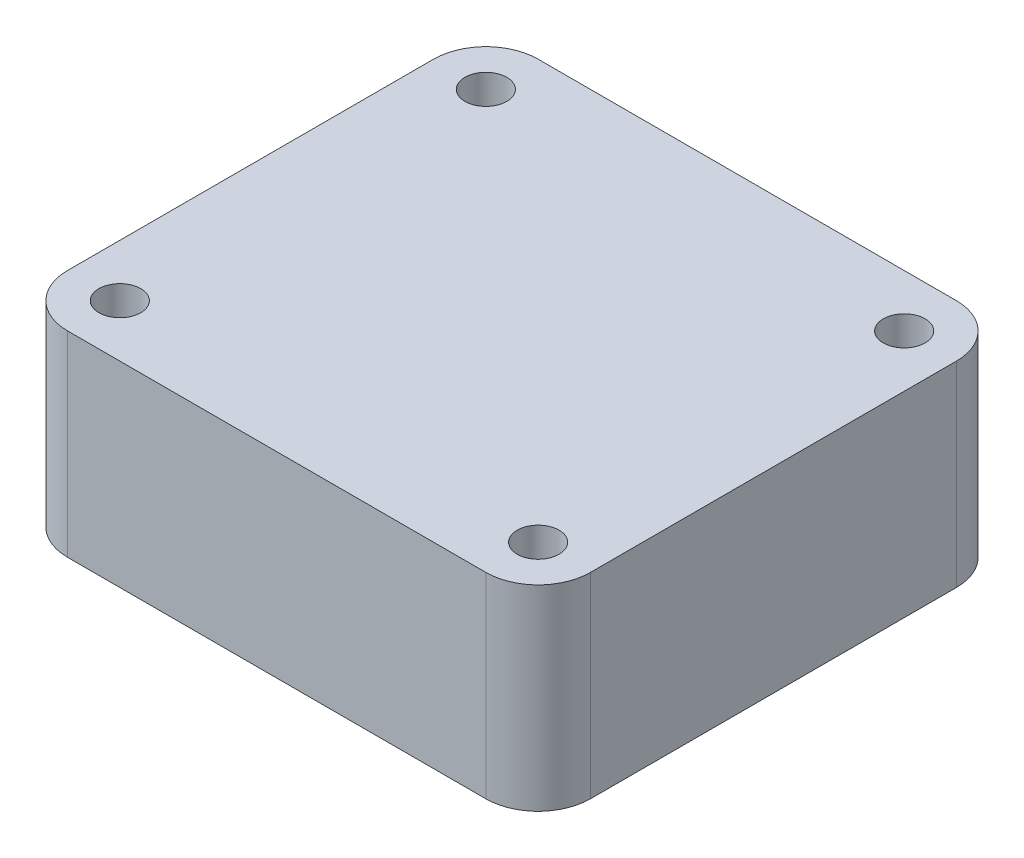
ISO-10303-21;
HEADER;
FILE_DESCRIPTION(('STEP AP214'),'2;1');
FILE_NAME('part.step','',(''),(''),'','','');
FILE_SCHEMA(('AUTOMOTIVE_DESIGN { 1 0 10303 214 1 1 1 1 }'));
ENDSEC;
DATA;
#1=APPLICATION_CONTEXT('core data for automotive mechanical design processes');
#2=APPLICATION_PROTOCOL_DEFINITION('international standard','automotive_design',2000,#1);
#3=PRODUCT_CONTEXT('',#1,'mechanical');
#4=PRODUCT('Part','Part','',(#3));
#5=PRODUCT_RELATED_PRODUCT_CATEGORY('part','',(#4));
#6=PRODUCT_DEFINITION_FORMATION('','',#4);
#7=PRODUCT_DEFINITION_CONTEXT('part definition',#1,'design');
#8=PRODUCT_DEFINITION('design','',#6,#7);
#9=PRODUCT_DEFINITION_SHAPE('','',#8);
#10=(LENGTH_UNIT() NAMED_UNIT(*) SI_UNIT(.MILLI.,.METRE.));
#11=(NAMED_UNIT(*) PLANE_ANGLE_UNIT() SI_UNIT($,.RADIAN.));
#12=(NAMED_UNIT(*) SI_UNIT($,.STERADIAN.) SOLID_ANGLE_UNIT());
#13=UNCERTAINTY_MEASURE_WITH_UNIT(LENGTH_MEASURE(1.E-05),#10,'distance_accuracy_value','');
#14=(GEOMETRIC_REPRESENTATION_CONTEXT(3) GLOBAL_UNCERTAINTY_ASSIGNED_CONTEXT((#13)) GLOBAL_UNIT_ASSIGNED_CONTEXT((#10,
#11,#12)) REPRESENTATION_CONTEXT('',''));
#15=CARTESIAN_POINT('',(0.,0.,0.));
#16=DIRECTION('',(0.,0.,1.));
#17=DIRECTION('',(1.,0.,0.));
#18=AXIS2_PLACEMENT_3D('',#15,#16,#17);
#19=CARTESIAN_POINT('',(-16.,15.,14.));
#20=DIRECTION('',(0.,-1.,0.));
#21=DIRECTION('',(0.,0.,-1.));
#22=AXIS2_PLACEMENT_3D('',#19,#20,#21);
#23=PLANE('',#22);
#24=CARTESIAN_POINT('',(-16.,15.,14.));
#25=DIRECTION('',(0.,1.,0.));
#26=DIRECTION('',(0.,0.,-1.));
#27=AXIS2_PLACEMENT_3D('',#24,#25,#26);
#28=CIRCLE('',#27,4.);
#29=CARTESIAN_POINT('',(-20.,15.,14.));
#30=VERTEX_POINT('',#29);
#31=CARTESIAN_POINT('',(-16.,15.,18.));
#32=VERTEX_POINT('',#31);
#33=EDGE_CURVE('E164',#30,#32,#28,.T.);
#34=ORIENTED_EDGE('',*,*,#33,.T.);
#35=DIRECTION('',(1.,0.,0.));
#36=VECTOR('',#35,1.);
#37=CARTESIAN_POINT('',(-16.,15.,18.));
#38=LINE('',#37,#36);
#39=CARTESIAN_POINT('',(16.,15.,18.));
#40=VERTEX_POINT('',#39);
#41=EDGE_CURVE('E100',#32,#40,#38,.T.);
#42=ORIENTED_EDGE('',*,*,#41,.T.);
#43=CARTESIAN_POINT('',(16.,15.,14.));
#44=DIRECTION('',(0.,1.,0.));
#45=DIRECTION('',(0.,0.,1.));
#46=AXIS2_PLACEMENT_3D('',#43,#44,#45);
#47=CIRCLE('',#46,4.);
#48=CARTESIAN_POINT('',(20.,15.,14.));
#49=VERTEX_POINT('',#48);
#50=EDGE_CURVE('E185',#40,#49,#47,.T.);
#51=ORIENTED_EDGE('',*,*,#50,.T.);
#52=DIRECTION('',(0.,0.,-1.));
#53=VECTOR('',#52,1.);
#54=CARTESIAN_POINT('',(20.,15.,14.));
#55=LINE('',#54,#53);
#56=CARTESIAN_POINT('',(20.,15.,-14.));
#57=VERTEX_POINT('',#56);
#58=EDGE_CURVE('E199',#49,#57,#55,.T.);
#59=ORIENTED_EDGE('',*,*,#58,.T.);
#60=CARTESIAN_POINT('',(16.,15.,-14.));
#61=DIRECTION('',(0.,1.,0.));
#62=DIRECTION('',(0.,0.,-1.));
#63=AXIS2_PLACEMENT_3D('',#60,#61,#62);
#64=CIRCLE('',#63,4.);
#65=CARTESIAN_POINT('',(16.,15.,-18.));
#66=VERTEX_POINT('',#65);
#67=EDGE_CURVE('E119',#57,#66,#64,.T.);
#68=ORIENTED_EDGE('',*,*,#67,.T.);
#69=DIRECTION('',(-1.,0.,0.));
#70=VECTOR('',#69,1.);
#71=CARTESIAN_POINT('',(-16.,15.,-18.));
#72=LINE('',#71,#70);
#73=CARTESIAN_POINT('',(-16.,15.,-18.));
#74=VERTEX_POINT('',#73);
#75=EDGE_CURVE('E113',#66,#74,#72,.T.);
#76=ORIENTED_EDGE('',*,*,#75,.T.);
#77=CARTESIAN_POINT('',(-16.,15.,-14.));
#78=DIRECTION('',(0.,1.,0.));
#79=DIRECTION('',(0.,0.,1.));
#80=AXIS2_PLACEMENT_3D('',#77,#78,#79);
#81=CIRCLE('',#80,4.);
#82=CARTESIAN_POINT('',(-20.,15.,-14.));
#83=VERTEX_POINT('',#82);
#84=EDGE_CURVE('E117',#74,#83,#81,.T.);
#85=ORIENTED_EDGE('',*,*,#84,.T.);
#86=DIRECTION('',(0.,0.,1.));
#87=VECTOR('',#86,1.);
#88=CARTESIAN_POINT('',(-20.,15.,14.));
#89=LINE('',#88,#87);
#90=EDGE_CURVE('E57',#83,#30,#89,.T.);
#91=ORIENTED_EDGE('',*,*,#90,.T.);
#92=EDGE_LOOP('',(#34,#42,#51,#59,#68,#76,#85,#91));
#93=FACE_BOUND('',#92,.T.);
#94=CARTESIAN_POINT('',(16.,15.,-14.));
#95=DIRECTION('',(0.,1.,0.));
#96=DIRECTION('',(0.,0.,1.));
#97=AXIS2_PLACEMENT_3D('',#94,#95,#96);
#98=CIRCLE('',#97,1.6);
#99=CARTESIAN_POINT('',(16.,15.,-12.4));
#100=VERTEX_POINT('',#99);
#101=EDGE_CURVE('E146',#100,#100,#98,.T.);
#102=ORIENTED_EDGE('',*,*,#101,.F.);
#103=EDGE_LOOP('',(#102));
#104=FACE_BOUND('',#103,.T.);
#105=CARTESIAN_POINT('',(-16.,15.,-14.));
#106=DIRECTION('',(0.,1.,0.));
#107=DIRECTION('',(0.,0.,1.));
#108=AXIS2_PLACEMENT_3D('',#105,#106,#107);
#109=CIRCLE('',#108,1.6);
#110=CARTESIAN_POINT('',(-16.,15.,-12.4));
#111=VERTEX_POINT('',#110);
#112=EDGE_CURVE('E213',#111,#111,#109,.T.);
#113=ORIENTED_EDGE('',*,*,#112,.F.);
#114=EDGE_LOOP('',(#113));
#115=FACE_BOUND('',#114,.T.);
#116=CARTESIAN_POINT('',(-16.,15.,14.));
#117=DIRECTION('',(0.,1.,0.));
#118=DIRECTION('',(0.,0.,1.));
#119=AXIS2_PLACEMENT_3D('',#116,#117,#118);
#120=CIRCLE('',#119,1.6);
#121=CARTESIAN_POINT('',(-16.,15.,15.6));
#122=VERTEX_POINT('',#121);
#123=EDGE_CURVE('E221',#122,#122,#120,.T.);
#124=ORIENTED_EDGE('',*,*,#123,.F.);
#125=EDGE_LOOP('',(#124));
#126=FACE_BOUND('',#125,.T.);
#127=CARTESIAN_POINT('',(16.,15.,14.));
#128=DIRECTION('',(0.,1.,0.));
#129=DIRECTION('',(0.,0.,1.));
#130=AXIS2_PLACEMENT_3D('',#127,#128,#129);
#131=CIRCLE('',#130,1.6);
#132=CARTESIAN_POINT('',(16.,15.,15.6));
#133=VERTEX_POINT('',#132);
#134=EDGE_CURVE('E229',#133,#133,#131,.T.);
#135=ORIENTED_EDGE('',*,*,#134,.F.);
#136=EDGE_LOOP('',(#135));
#137=FACE_BOUND('',#136,.T.);
#138=ADVANCED_FACE('F39',(#93,#104,#115,#126,#137),#23,.F.);
#139=CARTESIAN_POINT('',(-16.,0.,14.));
#140=DIRECTION('',(0.,-1.,0.));
#141=DIRECTION('',(0.,0.,-1.));
#142=AXIS2_PLACEMENT_3D('',#139,#140,#141);
#143=PLANE('',#142);
#144=CARTESIAN_POINT('',(-16.,0.,14.));
#145=DIRECTION('',(0.,1.,0.));
#146=DIRECTION('',(0.,0.,1.));
#147=AXIS2_PLACEMENT_3D('',#144,#145,#146);
#148=CIRCLE('',#147,1.6);
#149=CARTESIAN_POINT('',(-16.,0.,15.6));
#150=VERTEX_POINT('',#149);
#151=EDGE_CURVE('E225',#150,#150,#148,.T.);
#152=ORIENTED_EDGE('',*,*,#151,.T.);
#153=EDGE_LOOP('',(#152));
#154=FACE_BOUND('',#153,.T.);
#155=CARTESIAN_POINT('',(16.,0.,-14.));
#156=DIRECTION('',(0.,1.,0.));
#157=DIRECTION('',(0.,0.,1.));
#158=AXIS2_PLACEMENT_3D('',#155,#156,#157);
#159=CIRCLE('',#158,1.6);
#160=CARTESIAN_POINT('',(16.,0.,-12.4));
#161=VERTEX_POINT('',#160);
#162=EDGE_CURVE('E209',#161,#161,#159,.T.);
#163=ORIENTED_EDGE('',*,*,#162,.T.);
#164=EDGE_LOOP('',(#163));
#165=FACE_BOUND('',#164,.T.);
#166=CARTESIAN_POINT('',(-16.,0.,14.));
#167=DIRECTION('',(0.,1.,0.));
#168=DIRECTION('',(0.,0.,-1.));
#169=AXIS2_PLACEMENT_3D('',#166,#167,#168);
#170=CIRCLE('',#169,4.);
#171=CARTESIAN_POINT('',(-20.,0.,14.));
#172=VERTEX_POINT('',#171);
#173=CARTESIAN_POINT('',(-16.,0.,18.));
#174=VERTEX_POINT('',#173);
#175=EDGE_CURVE('E141',#172,#174,#170,.T.);
#176=ORIENTED_EDGE('',*,*,#175,.F.);
#177=DIRECTION('',(0.,0.,1.));
#178=VECTOR('',#177,1.);
#179=CARTESIAN_POINT('',(-20.,0.,14.));
#180=LINE('',#179,#178);
#181=CARTESIAN_POINT('',(-20.,0.,-14.));
#182=VERTEX_POINT('',#181);
#183=EDGE_CURVE('E92',#182,#172,#180,.T.);
#184=ORIENTED_EDGE('',*,*,#183,.F.);
#185=CARTESIAN_POINT('',(-16.,0.,-14.));
#186=DIRECTION('',(0.,1.,0.));
#187=DIRECTION('',(0.,0.,1.));
#188=AXIS2_PLACEMENT_3D('',#185,#186,#187);
#189=CIRCLE('',#188,4.);
#190=CARTESIAN_POINT('',(-16.,0.,-18.));
#191=VERTEX_POINT('',#190);
#192=EDGE_CURVE('E86',#191,#182,#189,.T.);
#193=ORIENTED_EDGE('',*,*,#192,.F.);
#194=DIRECTION('',(-1.,0.,0.));
#195=VECTOR('',#194,1.);
#196=CARTESIAN_POINT('',(-16.,0.,-18.));
#197=LINE('',#196,#195);
#198=CARTESIAN_POINT('',(16.,0.,-18.));
#199=VERTEX_POINT('',#198);
#200=EDGE_CURVE('E128',#199,#191,#197,.T.);
#201=ORIENTED_EDGE('',*,*,#200,.F.);
#202=CARTESIAN_POINT('',(16.,0.,-14.));
#203=DIRECTION('',(0.,1.,0.));
#204=DIRECTION('',(0.,0.,-1.));
#205=AXIS2_PLACEMENT_3D('',#202,#203,#204);
#206=CIRCLE('',#205,4.);
#207=CARTESIAN_POINT('',(20.,0.,-14.));
#208=VERTEX_POINT('',#207);
#209=EDGE_CURVE('E155',#208,#199,#206,.T.);
#210=ORIENTED_EDGE('',*,*,#209,.F.);
#211=DIRECTION('',(0.,0.,-1.));
#212=VECTOR('',#211,1.);
#213=CARTESIAN_POINT('',(20.,0.,14.));
#214=LINE('',#213,#212);
#215=CARTESIAN_POINT('',(20.,0.,14.));
#216=VERTEX_POINT('',#215);
#217=EDGE_CURVE('E152',#216,#208,#214,.T.);
#218=ORIENTED_EDGE('',*,*,#217,.F.);
#219=CARTESIAN_POINT('',(16.,0.,14.));
#220=DIRECTION('',(0.,1.,0.));
#221=DIRECTION('',(0.,0.,1.));
#222=AXIS2_PLACEMENT_3D('',#219,#220,#221);
#223=CIRCLE('',#222,4.);
#224=CARTESIAN_POINT('',(16.,0.,18.));
#225=VERTEX_POINT('',#224);
#226=EDGE_CURVE('E149',#225,#216,#223,.T.);
#227=ORIENTED_EDGE('',*,*,#226,.F.);
#228=DIRECTION('',(1.,0.,0.));
#229=VECTOR('',#228,1.);
#230=CARTESIAN_POINT('',(-16.,0.,18.));
#231=LINE('',#230,#229);
#232=EDGE_CURVE('E145',#174,#225,#231,.T.);
#233=ORIENTED_EDGE('',*,*,#232,.F.);
#234=EDGE_LOOP('',(#176,#184,#193,#201,#210,#218,#227,#233));
#235=FACE_BOUND('',#234,.T.);
#236=CARTESIAN_POINT('',(-16.,0.,-14.));
#237=DIRECTION('',(0.,1.,0.));
#238=DIRECTION('',(0.,0.,1.));
#239=AXIS2_PLACEMENT_3D('',#236,#237,#238);
#240=CIRCLE('',#239,1.6);
#241=CARTESIAN_POINT('',(-16.,0.,-12.4));
#242=VERTEX_POINT('',#241);
#243=EDGE_CURVE('E217',#242,#242,#240,.T.);
#244=ORIENTED_EDGE('',*,*,#243,.T.);
#245=EDGE_LOOP('',(#244));
#246=FACE_BOUND('',#245,.T.);
#247=CARTESIAN_POINT('',(16.,0.,14.));
#248=DIRECTION('',(0.,1.,0.));
#249=DIRECTION('',(0.,0.,1.));
#250=AXIS2_PLACEMENT_3D('',#247,#248,#249);
#251=CIRCLE('',#250,1.6);
#252=CARTESIAN_POINT('',(16.,0.,15.6));
#253=VERTEX_POINT('',#252);
#254=EDGE_CURVE('E233',#253,#253,#251,.T.);
#255=ORIENTED_EDGE('',*,*,#254,.T.);
#256=EDGE_LOOP('',(#255));
#257=FACE_BOUND('',#256,.T.);
#258=ADVANCED_FACE('F189',(#154,#165,#235,#246,#257),#143,.T.);
#259=CARTESIAN_POINT('',(-16.,15.,14.));
#260=DIRECTION('',(0.,-1.,0.));
#261=DIRECTION('',(0.,0.,-1.));
#262=AXIS2_PLACEMENT_3D('',#259,#260,#261);
#263=CYLINDRICAL_SURFACE('',#262,4.);
#264=ORIENTED_EDGE('',*,*,#175,.T.);
#265=DIRECTION('',(0.,-1.,0.));
#266=VECTOR('',#265,1.);
#267=CARTESIAN_POINT('',(-16.,15.,18.));
#268=LINE('',#267,#266);
#269=EDGE_CURVE('E11',#32,#174,#268,.T.);
#270=ORIENTED_EDGE('',*,*,#269,.F.);
#271=ORIENTED_EDGE('',*,*,#33,.F.);
#272=DIRECTION('',(0.,-1.,0.));
#273=VECTOR('',#272,1.);
#274=CARTESIAN_POINT('',(-20.,15.,14.));
#275=LINE('',#274,#273);
#276=EDGE_CURVE('E137',#30,#172,#275,.T.);
#277=ORIENTED_EDGE('',*,*,#276,.T.);
#278=EDGE_LOOP('',(#264,#270,#271,#277));
#279=FACE_BOUND('',#278,.T.);
#280=ADVANCED_FACE('F41',(#279),#263,.T.);
#281=CARTESIAN_POINT('',(-16.,15.,18.));
#282=DIRECTION('',(0.,0.,-1.));
#283=DIRECTION('',(-1.,0.,0.));
#284=AXIS2_PLACEMENT_3D('',#281,#282,#283);
#285=PLANE('',#284);
#286=ORIENTED_EDGE('',*,*,#232,.T.);
#287=DIRECTION('',(0.,-1.,0.));
#288=VECTOR('',#287,1.);
#289=CARTESIAN_POINT('',(16.,15.,18.));
#290=LINE('',#289,#288);
#291=EDGE_CURVE('E49',#40,#225,#290,.T.);
#292=ORIENTED_EDGE('',*,*,#291,.F.);
#293=ORIENTED_EDGE('',*,*,#41,.F.);
#294=ORIENTED_EDGE('',*,*,#269,.T.);
#295=EDGE_LOOP('',(#286,#292,#293,#294));
#296=FACE_BOUND('',#295,.T.);
#297=ADVANCED_FACE('F267',(#296),#285,.F.);
#298=CARTESIAN_POINT('',(16.,15.,14.));
#299=DIRECTION('',(0.,-1.,0.));
#300=DIRECTION('',(0.,0.,-1.));
#301=AXIS2_PLACEMENT_3D('',#298,#299,#300);
#302=CYLINDRICAL_SURFACE('',#301,4.);
#303=ORIENTED_EDGE('',*,*,#226,.T.);
#304=DIRECTION('',(0.,-1.,0.));
#305=VECTOR('',#304,1.);
#306=CARTESIAN_POINT('',(20.,15.,14.));
#307=LINE('',#306,#305);
#308=EDGE_CURVE('E175',#49,#216,#307,.T.);
#309=ORIENTED_EDGE('',*,*,#308,.F.);
#310=ORIENTED_EDGE('',*,*,#50,.F.);
#311=ORIENTED_EDGE('',*,*,#291,.T.);
#312=EDGE_LOOP('',(#303,#309,#310,#311));
#313=FACE_BOUND('',#312,.T.);
#314=ADVANCED_FACE('F183',(#313),#302,.T.);
#315=CARTESIAN_POINT('',(20.,15.,14.));
#316=DIRECTION('',(-1.,0.,0.));
#317=DIRECTION('',(0.,0.,1.));
#318=AXIS2_PLACEMENT_3D('',#315,#316,#317);
#319=PLANE('',#318);
#320=ORIENTED_EDGE('',*,*,#217,.T.);
#321=DIRECTION('',(0.,-1.,0.));
#322=VECTOR('',#321,1.);
#323=CARTESIAN_POINT('',(20.,15.,-14.));
#324=LINE('',#323,#322);
#325=EDGE_CURVE('E171',#57,#208,#324,.T.);
#326=ORIENTED_EDGE('',*,*,#325,.F.);
#327=ORIENTED_EDGE('',*,*,#58,.F.);
#328=ORIENTED_EDGE('',*,*,#308,.T.);
#329=EDGE_LOOP('',(#320,#326,#327,#328));
#330=FACE_BOUND('',#329,.T.);
#331=ADVANCED_FACE('F194',(#330),#319,.F.);
#332=CARTESIAN_POINT('',(16.,15.,-14.));
#333=DIRECTION('',(0.,-1.,0.));
#334=DIRECTION('',(0.,0.,-1.));
#335=AXIS2_PLACEMENT_3D('',#332,#333,#334);
#336=CYLINDRICAL_SURFACE('',#335,4.);
#337=ORIENTED_EDGE('',*,*,#209,.T.);
#338=DIRECTION('',(0.,-1.,0.));
#339=VECTOR('',#338,1.);
#340=CARTESIAN_POINT('',(16.,15.,-18.));
#341=LINE('',#340,#339);
#342=EDGE_CURVE('E130',#66,#199,#341,.T.);
#343=ORIENTED_EDGE('',*,*,#342,.F.);
#344=ORIENTED_EDGE('',*,*,#67,.F.);
#345=ORIENTED_EDGE('',*,*,#325,.T.);
#346=EDGE_LOOP('',(#337,#343,#344,#345));
#347=FACE_BOUND('',#346,.T.);
#348=ADVANCED_FACE('F197',(#347),#336,.T.);
#349=CARTESIAN_POINT('',(-16.,15.,-18.));
#350=DIRECTION('',(0.,0.,1.));
#351=DIRECTION('',(1.,0.,0.));
#352=AXIS2_PLACEMENT_3D('',#349,#350,#351);
#353=PLANE('',#352);
#354=ORIENTED_EDGE('',*,*,#200,.T.);
#355=DIRECTION('',(0.,-1.,0.));
#356=VECTOR('',#355,1.);
#357=CARTESIAN_POINT('',(-16.,15.,-18.));
#358=LINE('',#357,#356);
#359=EDGE_CURVE('E125',#74,#191,#358,.T.);
#360=ORIENTED_EDGE('',*,*,#359,.F.);
#361=ORIENTED_EDGE('',*,*,#75,.F.);
#362=ORIENTED_EDGE('',*,*,#342,.T.);
#363=EDGE_LOOP('',(#354,#360,#361,#362));
#364=FACE_BOUND('',#363,.T.);
#365=ADVANCED_FACE('F126',(#364),#353,.F.);
#366=CARTESIAN_POINT('',(-16.,15.,-14.));
#367=DIRECTION('',(0.,-1.,0.));
#368=DIRECTION('',(0.,0.,-1.));
#369=AXIS2_PLACEMENT_3D('',#366,#367,#368);
#370=CYLINDRICAL_SURFACE('',#369,4.);
#371=ORIENTED_EDGE('',*,*,#192,.T.);
#372=DIRECTION('',(0.,-1.,0.));
#373=VECTOR('',#372,1.);
#374=CARTESIAN_POINT('',(-20.,15.,-14.));
#375=LINE('',#374,#373);
#376=EDGE_CURVE('E131',#83,#182,#375,.T.);
#377=ORIENTED_EDGE('',*,*,#376,.F.);
#378=ORIENTED_EDGE('',*,*,#84,.F.);
#379=ORIENTED_EDGE('',*,*,#359,.T.);
#380=EDGE_LOOP('',(#371,#377,#378,#379));
#381=FACE_BOUND('',#380,.T.);
#382=ADVANCED_FACE('F133',(#381),#370,.T.);
#383=CARTESIAN_POINT('',(-20.,15.,14.));
#384=DIRECTION('',(1.,0.,0.));
#385=DIRECTION('',(0.,0.,-1.));
#386=AXIS2_PLACEMENT_3D('',#383,#384,#385);
#387=PLANE('',#386);
#388=ORIENTED_EDGE('',*,*,#183,.T.);
#389=ORIENTED_EDGE('',*,*,#276,.F.);
#390=ORIENTED_EDGE('',*,*,#90,.F.);
#391=ORIENTED_EDGE('',*,*,#376,.T.);
#392=EDGE_LOOP('',(#388,#389,#390,#391));
#393=FACE_BOUND('',#392,.T.);
#394=ADVANCED_FACE('F255',(#393),#387,.F.);
#395=CARTESIAN_POINT('',(16.,15.,-14.));
#396=DIRECTION('',(0.,-1.,0.));
#397=DIRECTION('',(0.,0.,-1.));
#398=AXIS2_PLACEMENT_3D('',#395,#396,#397);
#399=CYLINDRICAL_SURFACE('',#398,1.6);
#400=ORIENTED_EDGE('',*,*,#101,.T.);
#401=EDGE_LOOP('',(#400));
#402=FACE_BOUND('',#401,.T.);
#403=ORIENTED_EDGE('',*,*,#162,.F.);
#404=EDGE_LOOP('',(#403));
#405=FACE_BOUND('',#404,.T.);
#406=ADVANCED_FACE('F252',(#402,#405),#399,.F.);
#407=CARTESIAN_POINT('',(-16.,15.,-14.));
#408=DIRECTION('',(0.,-1.,0.));
#409=DIRECTION('',(0.,0.,-1.));
#410=AXIS2_PLACEMENT_3D('',#407,#408,#409);
#411=CYLINDRICAL_SURFACE('',#410,1.6);
#412=ORIENTED_EDGE('',*,*,#112,.T.);
#413=EDGE_LOOP('',(#412));
#414=FACE_BOUND('',#413,.T.);
#415=ORIENTED_EDGE('',*,*,#243,.F.);
#416=EDGE_LOOP('',(#415));
#417=FACE_BOUND('',#416,.T.);
#418=ADVANCED_FACE('F331',(#414,#417),#411,.F.);
#419=CARTESIAN_POINT('',(-16.,15.,14.));
#420=DIRECTION('',(0.,-1.,0.));
#421=DIRECTION('',(0.,0.,-1.));
#422=AXIS2_PLACEMENT_3D('',#419,#420,#421);
#423=CYLINDRICAL_SURFACE('',#422,1.6);
#424=ORIENTED_EDGE('',*,*,#123,.T.);
#425=EDGE_LOOP('',(#424));
#426=FACE_BOUND('',#425,.T.);
#427=ORIENTED_EDGE('',*,*,#151,.F.);
#428=EDGE_LOOP('',(#427));
#429=FACE_BOUND('',#428,.T.);
#430=ADVANCED_FACE('F339',(#426,#429),#423,.F.);
#431=CARTESIAN_POINT('',(16.,15.,14.));
#432=DIRECTION('',(0.,-1.,0.));
#433=DIRECTION('',(0.,0.,-1.));
#434=AXIS2_PLACEMENT_3D('',#431,#432,#433);
#435=CYLINDRICAL_SURFACE('',#434,1.6);
#436=ORIENTED_EDGE('',*,*,#134,.T.);
#437=EDGE_LOOP('',(#436));
#438=FACE_BOUND('',#437,.T.);
#439=ORIENTED_EDGE('',*,*,#254,.F.);
#440=EDGE_LOOP('',(#439));
#441=FACE_BOUND('',#440,.T.);
#442=ADVANCED_FACE('F241',(#438,#441),#435,.F.);
#443=CLOSED_SHELL('',(#138,#258,#280,#297,#314,#331,#348,#365,#382,#394,#406,#418,#430,#442));
#444=MANIFOLD_SOLID_BREP('B2',#443);
#445=ADVANCED_BREP_SHAPE_REPRESENTATION('',(#18,#444),#14);
#446=SHAPE_DEFINITION_REPRESENTATION(#9,#445);
ENDSEC;
END-ISO-10303-21;
